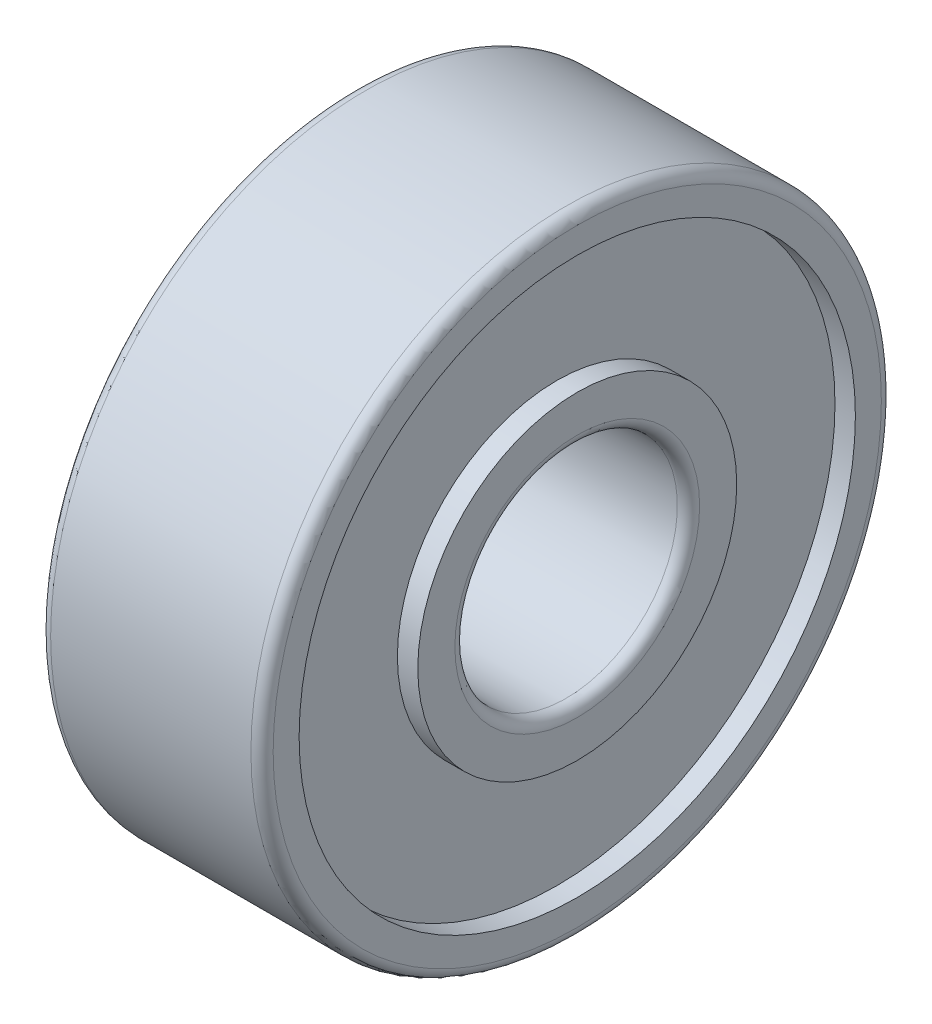
ISO-10303-21;
HEADER;
FILE_DESCRIPTION(('STEP AP214'),'2;1');
FILE_NAME('part.step','',(''),(''),'','','');
FILE_SCHEMA(('AUTOMOTIVE_DESIGN { 1 0 10303 214 1 1 1 1 }'));
ENDSEC;
DATA;
#1=APPLICATION_CONTEXT('core data for automotive mechanical design processes');
#2=APPLICATION_PROTOCOL_DEFINITION('international standard','automotive_design',2000,#1);
#3=PRODUCT_CONTEXT('',#1,'mechanical');
#4=PRODUCT('Part','Part','',(#3));
#5=PRODUCT_RELATED_PRODUCT_CATEGORY('part','',(#4));
#6=PRODUCT_DEFINITION_FORMATION('','',#4);
#7=PRODUCT_DEFINITION_CONTEXT('part definition',#1,'design');
#8=PRODUCT_DEFINITION('design','',#6,#7);
#9=PRODUCT_DEFINITION_SHAPE('','',#8);
#10=(LENGTH_UNIT() NAMED_UNIT(*) SI_UNIT(.MILLI.,.METRE.));
#11=(NAMED_UNIT(*) PLANE_ANGLE_UNIT() SI_UNIT($,.RADIAN.));
#12=(NAMED_UNIT(*) SI_UNIT($,.STERADIAN.) SOLID_ANGLE_UNIT());
#13=UNCERTAINTY_MEASURE_WITH_UNIT(LENGTH_MEASURE(1.E-05),#10,'distance_accuracy_value','');
#14=(GEOMETRIC_REPRESENTATION_CONTEXT(3) GLOBAL_UNCERTAINTY_ASSIGNED_CONTEXT((#13)) GLOBAL_UNIT_ASSIGNED_CONTEXT((#10,
#11,#12)) REPRESENTATION_CONTEXT('',''));
#15=CARTESIAN_POINT('',(0.,0.,0.));
#16=DIRECTION('',(0.,0.,1.));
#17=DIRECTION('',(1.,0.,0.));
#18=AXIS2_PLACEMENT_3D('',#15,#16,#17);
#19=CARTESIAN_POINT('',(0.,4.3,0.));
#20=DIRECTION('',(1.,0.,0.));
#21=DIRECTION('',(0.,0.,-1.));
#22=AXIS2_PLACEMENT_3D('',#19,#20,#21);
#23=PLANE('',#22);
#24=CARTESIAN_POINT('',(0.,0.,0.));
#25=DIRECTION('',(1.,0.,0.));
#26=DIRECTION('',(0.,0.,-1.));
#27=AXIS2_PLACEMENT_3D('',#24,#25,#26);
#28=CIRCLE('',#27,3.3);
#29=CARTESIAN_POINT('',(0.,0.,-3.3));
#30=VERTEX_POINT('',#29);
#31=EDGE_CURVE('E65',#30,#30,#28,.T.);
#32=ORIENTED_EDGE('',*,*,#31,.T.);
#33=EDGE_LOOP('',(#32));
#34=FACE_BOUND('',#33,.T.);
#35=CARTESIAN_POINT('',(0.,0.,0.));
#36=DIRECTION('',(-1.,0.,0.));
#37=DIRECTION('',(0.,0.,1.));
#38=AXIS2_PLACEMENT_3D('',#35,#36,#37);
#39=CIRCLE('',#38,4.3);
#40=CARTESIAN_POINT('',(0.,0.,4.3));
#41=VERTEX_POINT('',#40);
#42=EDGE_CURVE('E103',#41,#41,#39,.T.);
#43=ORIENTED_EDGE('',*,*,#42,.T.);
#44=EDGE_LOOP('',(#43));
#45=FACE_BOUND('',#44,.T.);
#46=ADVANCED_FACE('F35',(#34,#45),#23,.F.);
#47=CARTESIAN_POINT('',(0.,0.,0.));
#48=DIRECTION('',(-1.,0.,0.));
#49=DIRECTION('',(0.,0.,1.));
#50=AXIS2_PLACEMENT_3D('',#47,#48,#49);
#51=CYLINDRICAL_SURFACE('',#50,3.);
#52=CARTESIAN_POINT('',(0.3,0.,0.));
#53=DIRECTION('',(1.,0.,0.));
#54=DIRECTION('',(0.,0.,-1.));
#55=AXIS2_PLACEMENT_3D('',#52,#53,#54);
#56=CIRCLE('',#55,3.);
#57=CARTESIAN_POINT('',(0.3,0.,-3.));
#58=VERTEX_POINT('',#57);
#59=EDGE_CURVE('E69',#58,#58,#56,.F.);
#60=ORIENTED_EDGE('',*,*,#59,.T.);
#61=EDGE_LOOP('',(#60));
#62=FACE_BOUND('',#61,.T.);
#63=CARTESIAN_POINT('',(5.7,0.,0.));
#64=DIRECTION('',(-1.,0.,0.));
#65=DIRECTION('',(0.,0.,1.));
#66=AXIS2_PLACEMENT_3D('',#63,#64,#65);
#67=CIRCLE('',#66,3.);
#68=CARTESIAN_POINT('',(5.7,0.,3.));
#69=VERTEX_POINT('',#68);
#70=EDGE_CURVE('E73',#69,#69,#67,.F.);
#71=ORIENTED_EDGE('',*,*,#70,.T.);
#72=EDGE_LOOP('',(#71));
#73=FACE_BOUND('',#72,.T.);
#74=ADVANCED_FACE('F139',(#62,#73),#51,.F.);
#75=CARTESIAN_POINT('',(6.,3.,0.));
#76=DIRECTION('',(-1.,0.,0.));
#77=DIRECTION('',(0.,0.,1.));
#78=AXIS2_PLACEMENT_3D('',#75,#76,#77);
#79=PLANE('',#78);
#80=CARTESIAN_POINT('',(6.,0.,0.));
#81=DIRECTION('',(-1.,0.,0.));
#82=DIRECTION('',(0.,0.,1.));
#83=AXIS2_PLACEMENT_3D('',#80,#81,#82);
#84=CIRCLE('',#83,3.3);
#85=CARTESIAN_POINT('',(6.,0.,3.3));
#86=VERTEX_POINT('',#85);
#87=EDGE_CURVE('E61',#86,#86,#84,.T.);
#88=ORIENTED_EDGE('',*,*,#87,.T.);
#89=EDGE_LOOP('',(#88));
#90=FACE_BOUND('',#89,.T.);
#91=CARTESIAN_POINT('',(6.,0.,0.));
#92=DIRECTION('',(-1.,0.,0.));
#93=DIRECTION('',(0.,0.,1.));
#94=AXIS2_PLACEMENT_3D('',#91,#92,#93);
#95=CIRCLE('',#94,4.3);
#96=CARTESIAN_POINT('',(6.,0.,4.3));
#97=VERTEX_POINT('',#96);
#98=EDGE_CURVE('E77',#97,#97,#95,.T.);
#99=ORIENTED_EDGE('',*,*,#98,.F.);
#100=EDGE_LOOP('',(#99));
#101=FACE_BOUND('',#100,.T.);
#102=ADVANCED_FACE('F145',(#90,#101),#79,.F.);
#103=CARTESIAN_POINT('',(0.,0.,0.));
#104=DIRECTION('',(-1.,0.,0.));
#105=DIRECTION('',(0.,0.,1.));
#106=AXIS2_PLACEMENT_3D('',#103,#104,#105);
#107=CYLINDRICAL_SURFACE('',#106,4.3);
#108=CARTESIAN_POINT('',(5.45,0.,0.));
#109=DIRECTION('',(-1.,0.,0.));
#110=DIRECTION('',(0.,0.,1.));
#111=AXIS2_PLACEMENT_3D('',#108,#109,#110);
#112=CIRCLE('',#111,4.3);
#113=CARTESIAN_POINT('',(5.45,0.,4.3));
#114=VERTEX_POINT('',#113);
#115=EDGE_CURVE('E81',#114,#114,#112,.T.);
#116=ORIENTED_EDGE('',*,*,#115,.F.);
#117=EDGE_LOOP('',(#116));
#118=FACE_BOUND('',#117,.T.);
#119=ORIENTED_EDGE('',*,*,#98,.T.);
#120=EDGE_LOOP('',(#119));
#121=FACE_BOUND('',#120,.T.);
#122=ADVANCED_FACE('F219',(#118,#121),#107,.T.);
#123=CARTESIAN_POINT('',(5.45,4.3,0.));
#124=DIRECTION('',(-1.,0.,0.));
#125=DIRECTION('',(0.,0.,1.));
#126=AXIS2_PLACEMENT_3D('',#123,#124,#125);
#127=PLANE('',#126);
#128=CARTESIAN_POINT('',(5.45,0.,0.));
#129=DIRECTION('',(-1.,0.,0.));
#130=DIRECTION('',(0.,0.,1.));
#131=AXIS2_PLACEMENT_3D('',#128,#129,#130);
#132=CIRCLE('',#131,7.5);
#133=CARTESIAN_POINT('',(5.45,0.,7.5));
#134=VERTEX_POINT('',#133);
#135=EDGE_CURVE('E85',#134,#134,#132,.T.);
#136=ORIENTED_EDGE('',*,*,#135,.F.);
#137=EDGE_LOOP('',(#136));
#138=FACE_BOUND('',#137,.T.);
#139=ORIENTED_EDGE('',*,*,#115,.T.);
#140=EDGE_LOOP('',(#139));
#141=FACE_BOUND('',#140,.T.);
#142=ADVANCED_FACE('F252',(#138,#141),#127,.F.);
#143=CARTESIAN_POINT('',(0.,0.,0.));
#144=DIRECTION('',(-1.,0.,0.));
#145=DIRECTION('',(0.,0.,1.));
#146=AXIS2_PLACEMENT_3D('',#143,#144,#145);
#147=CYLINDRICAL_SURFACE('',#146,7.5);
#148=CARTESIAN_POINT('',(6.,0.,0.));
#149=DIRECTION('',(-1.,0.,0.));
#150=DIRECTION('',(0.,0.,1.));
#151=AXIS2_PLACEMENT_3D('',#148,#149,#150);
#152=CIRCLE('',#151,7.5);
#153=CARTESIAN_POINT('',(6.,0.,7.5));
#154=VERTEX_POINT('',#153);
#155=EDGE_CURVE('E89',#154,#154,#152,.T.);
#156=ORIENTED_EDGE('',*,*,#155,.F.);
#157=EDGE_LOOP('',(#156));
#158=FACE_BOUND('',#157,.T.);
#159=ORIENTED_EDGE('',*,*,#135,.T.);
#160=EDGE_LOOP('',(#159));
#161=FACE_BOUND('',#160,.T.);
#162=ADVANCED_FACE('F207',(#158,#161),#147,.F.);
#163=CARTESIAN_POINT('',(6.,7.5,0.));
#164=DIRECTION('',(-1.,0.,0.));
#165=DIRECTION('',(0.,0.,1.));
#166=AXIS2_PLACEMENT_3D('',#163,#164,#165);
#167=PLANE('',#166);
#168=CARTESIAN_POINT('',(6.,0.,0.));
#169=DIRECTION('',(-1.,0.,0.));
#170=DIRECTION('',(0.,0.,1.));
#171=AXIS2_PLACEMENT_3D('',#168,#169,#170);
#172=CIRCLE('',#171,8.2);
#173=CARTESIAN_POINT('',(6.,0.,8.2));
#174=VERTEX_POINT('',#173);
#175=EDGE_CURVE('E10',#174,#174,#172,.F.);
#176=ORIENTED_EDGE('',*,*,#175,.T.);
#177=EDGE_LOOP('',(#176));
#178=FACE_BOUND('',#177,.T.);
#179=ORIENTED_EDGE('',*,*,#155,.T.);
#180=EDGE_LOOP('',(#179));
#181=FACE_BOUND('',#180,.T.);
#182=ADVANCED_FACE('F136',(#178,#181),#167,.F.);
#183=CARTESIAN_POINT('',(0.,0.,0.));
#184=DIRECTION('',(-1.,0.,0.));
#185=DIRECTION('',(0.,0.,1.));
#186=AXIS2_PLACEMENT_3D('',#183,#184,#185);
#187=CYLINDRICAL_SURFACE('',#186,8.5);
#188=CARTESIAN_POINT('',(0.3,0.,0.));
#189=DIRECTION('',(1.,0.,0.));
#190=DIRECTION('',(0.,0.,-1.));
#191=AXIS2_PLACEMENT_3D('',#188,#189,#190);
#192=CIRCLE('',#191,8.5);
#193=CARTESIAN_POINT('',(0.3,0.,-8.5));
#194=VERTEX_POINT('',#193);
#195=EDGE_CURVE('E43',#194,#194,#192,.T.);
#196=ORIENTED_EDGE('',*,*,#195,.T.);
#197=EDGE_LOOP('',(#196));
#198=FACE_BOUND('',#197,.T.);
#199=CARTESIAN_POINT('',(5.7,0.,0.));
#200=DIRECTION('',(-1.,0.,0.));
#201=DIRECTION('',(0.,0.,1.));
#202=AXIS2_PLACEMENT_3D('',#199,#200,#201);
#203=CIRCLE('',#202,8.5);
#204=CARTESIAN_POINT('',(5.7,0.,8.5));
#205=VERTEX_POINT('',#204);
#206=EDGE_CURVE('E50',#205,#205,#203,.T.);
#207=ORIENTED_EDGE('',*,*,#206,.T.);
#208=EDGE_LOOP('',(#207));
#209=FACE_BOUND('',#208,.T.);
#210=ADVANCED_FACE('F130',(#198,#209),#187,.T.);
#211=CARTESIAN_POINT('',(0.,8.5,0.));
#212=DIRECTION('',(1.,0.,0.));
#213=DIRECTION('',(0.,0.,-1.));
#214=AXIS2_PLACEMENT_3D('',#211,#212,#213);
#215=PLANE('',#214);
#216=CARTESIAN_POINT('',(0.,0.,0.));
#217=DIRECTION('',(1.,0.,0.));
#218=DIRECTION('',(0.,0.,-1.));
#219=AXIS2_PLACEMENT_3D('',#216,#217,#218);
#220=CIRCLE('',#219,8.2);
#221=CARTESIAN_POINT('',(0.,0.,-8.2));
#222=VERTEX_POINT('',#221);
#223=EDGE_CURVE('E56',#222,#222,#220,.F.);
#224=ORIENTED_EDGE('',*,*,#223,.T.);
#225=EDGE_LOOP('',(#224));
#226=FACE_BOUND('',#225,.T.);
#227=CARTESIAN_POINT('',(0.,0.,0.));
#228=DIRECTION('',(-1.,0.,0.));
#229=DIRECTION('',(0.,0.,1.));
#230=AXIS2_PLACEMENT_3D('',#227,#228,#229);
#231=CIRCLE('',#230,7.5);
#232=CARTESIAN_POINT('',(0.,0.,7.5));
#233=VERTEX_POINT('',#232);
#234=EDGE_CURVE('E92',#233,#233,#231,.T.);
#235=ORIENTED_EDGE('',*,*,#234,.F.);
#236=EDGE_LOOP('',(#235));
#237=FACE_BOUND('',#236,.T.);
#238=ADVANCED_FACE('F125',(#226,#237),#215,.F.);
#239=CARTESIAN_POINT('',(0.,0.,0.));
#240=DIRECTION('',(-1.,0.,0.));
#241=DIRECTION('',(0.,0.,1.));
#242=AXIS2_PLACEMENT_3D('',#239,#240,#241);
#243=CYLINDRICAL_SURFACE('',#242,7.5);
#244=CARTESIAN_POINT('',(0.55,0.,0.));
#245=DIRECTION('',(-1.,0.,0.));
#246=DIRECTION('',(0.,0.,1.));
#247=AXIS2_PLACEMENT_3D('',#244,#245,#246);
#248=CIRCLE('',#247,7.5);
#249=CARTESIAN_POINT('',(0.55,0.,7.5));
#250=VERTEX_POINT('',#249);
#251=EDGE_CURVE('E96',#250,#250,#248,.T.);
#252=ORIENTED_EDGE('',*,*,#251,.F.);
#253=EDGE_LOOP('',(#252));
#254=FACE_BOUND('',#253,.T.);
#255=ORIENTED_EDGE('',*,*,#234,.T.);
#256=EDGE_LOOP('',(#255));
#257=FACE_BOUND('',#256,.T.);
#258=ADVANCED_FACE('F119',(#254,#257),#243,.F.);
#259=CARTESIAN_POINT('',(0.55,7.5,0.));
#260=DIRECTION('',(1.,0.,0.));
#261=DIRECTION('',(0.,0.,-1.));
#262=AXIS2_PLACEMENT_3D('',#259,#260,#261);
#263=PLANE('',#262);
#264=CARTESIAN_POINT('',(0.55,0.,0.));
#265=DIRECTION('',(-1.,0.,0.));
#266=DIRECTION('',(0.,0.,1.));
#267=AXIS2_PLACEMENT_3D('',#264,#265,#266);
#268=CIRCLE('',#267,4.3);
#269=CARTESIAN_POINT('',(0.55,0.,4.3));
#270=VERTEX_POINT('',#269);
#271=EDGE_CURVE('E100',#270,#270,#268,.T.);
#272=ORIENTED_EDGE('',*,*,#271,.F.);
#273=EDGE_LOOP('',(#272));
#274=FACE_BOUND('',#273,.T.);
#275=ORIENTED_EDGE('',*,*,#251,.T.);
#276=EDGE_LOOP('',(#275));
#277=FACE_BOUND('',#276,.T.);
#278=ADVANCED_FACE('F113',(#274,#277),#263,.F.);
#279=CARTESIAN_POINT('',(0.,0.,0.));
#280=DIRECTION('',(-1.,0.,0.));
#281=DIRECTION('',(0.,0.,1.));
#282=AXIS2_PLACEMENT_3D('',#279,#280,#281);
#283=CYLINDRICAL_SURFACE('',#282,4.3);
#284=ORIENTED_EDGE('',*,*,#42,.F.);
#285=EDGE_LOOP('',(#284));
#286=FACE_BOUND('',#285,.T.);
#287=ORIENTED_EDGE('',*,*,#271,.T.);
#288=EDGE_LOOP('',(#287));
#289=FACE_BOUND('',#288,.T.);
#290=ADVANCED_FACE('F109',(#286,#289),#283,.T.);
#291=CARTESIAN_POINT('',(0.3,0.,0.));
#292=DIRECTION('',(1.,0.,0.));
#293=DIRECTION('',(0.,0.,-1.));
#294=AXIS2_PLACEMENT_3D('',#291,#292,#293);
#295=TOROIDAL_SURFACE('',#294,3.3,0.3);
#296=ORIENTED_EDGE('',*,*,#31,.F.);
#297=EDGE_LOOP('',(#296));
#298=FACE_BOUND('',#297,.T.);
#299=ORIENTED_EDGE('',*,*,#59,.F.);
#300=EDGE_LOOP('',(#299));
#301=FACE_BOUND('',#300,.T.);
#302=ADVANCED_FACE('F112',(#298,#301),#295,.T.);
#303=CARTESIAN_POINT('',(5.7,0.,0.));
#304=DIRECTION('',(-1.,0.,0.));
#305=DIRECTION('',(0.,0.,1.));
#306=AXIS2_PLACEMENT_3D('',#303,#304,#305);
#307=TOROIDAL_SURFACE('',#306,3.3,0.3);
#308=ORIENTED_EDGE('',*,*,#70,.F.);
#309=EDGE_LOOP('',(#308));
#310=FACE_BOUND('',#309,.T.);
#311=ORIENTED_EDGE('',*,*,#87,.F.);
#312=EDGE_LOOP('',(#311));
#313=FACE_BOUND('',#312,.T.);
#314=ADVANCED_FACE('F152',(#310,#313),#307,.T.);
#315=CARTESIAN_POINT('',(0.3,0.,0.));
#316=DIRECTION('',(1.,0.,0.));
#317=DIRECTION('',(0.,0.,-1.));
#318=AXIS2_PLACEMENT_3D('',#315,#316,#317);
#319=TOROIDAL_SURFACE('',#318,8.2,0.3);
#320=ORIENTED_EDGE('',*,*,#195,.F.);
#321=EDGE_LOOP('',(#320));
#322=FACE_BOUND('',#321,.T.);
#323=ORIENTED_EDGE('',*,*,#223,.F.);
#324=EDGE_LOOP('',(#323));
#325=FACE_BOUND('',#324,.T.);
#326=ADVANCED_FACE('F155',(#322,#325),#319,.T.);
#327=CARTESIAN_POINT('',(5.7,0.,0.));
#328=DIRECTION('',(-1.,0.,0.));
#329=DIRECTION('',(0.,0.,1.));
#330=AXIS2_PLACEMENT_3D('',#327,#328,#329);
#331=TOROIDAL_SURFACE('',#330,8.2,0.3);
#332=ORIENTED_EDGE('',*,*,#175,.F.);
#333=EDGE_LOOP('',(#332));
#334=FACE_BOUND('',#333,.T.);
#335=ORIENTED_EDGE('',*,*,#206,.F.);
#336=EDGE_LOOP('',(#335));
#337=FACE_BOUND('',#336,.T.);
#338=ADVANCED_FACE('F37',(#334,#337),#331,.T.);
#339=CLOSED_SHELL('',(#46,#74,#102,#122,#142,#162,#182,#210,#238,#258,#278,#290,#302,#314,#326,#338));
#340=MANIFOLD_SOLID_BREP('B2',#339);
#341=ADVANCED_BREP_SHAPE_REPRESENTATION('',(#18,#340),#14);
#342=SHAPE_DEFINITION_REPRESENTATION(#9,#341);
ENDSEC;
END-ISO-10303-21;
